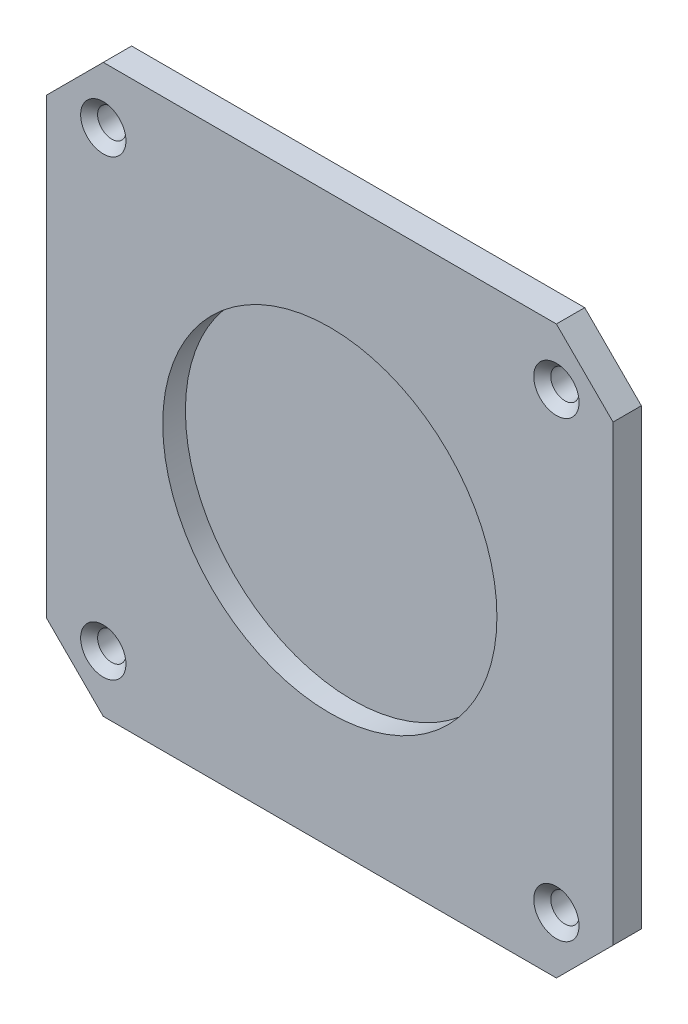
ISO-10303-21;
HEADER;
FILE_DESCRIPTION(('STEP AP214'),'2;1');
FILE_NAME('part.step','',(''),(''),'','','');
FILE_SCHEMA(('AUTOMOTIVE_DESIGN { 1 0 10303 214 1 1 1 1 }'));
ENDSEC;
DATA;
#1=APPLICATION_CONTEXT('core data for automotive mechanical design processes');
#2=APPLICATION_PROTOCOL_DEFINITION('international standard','automotive_design',2000,#1);
#3=PRODUCT_CONTEXT('',#1,'mechanical');
#4=PRODUCT('Part','Part','',(#3));
#5=PRODUCT_RELATED_PRODUCT_CATEGORY('part','',(#4));
#6=PRODUCT_DEFINITION_FORMATION('','',#4);
#7=PRODUCT_DEFINITION_CONTEXT('part definition',#1,'design');
#8=PRODUCT_DEFINITION('design','',#6,#7);
#9=PRODUCT_DEFINITION_SHAPE('','',#8);
#10=(LENGTH_UNIT() NAMED_UNIT(*) SI_UNIT(.MILLI.,.METRE.));
#11=(NAMED_UNIT(*) PLANE_ANGLE_UNIT() SI_UNIT($,.RADIAN.));
#12=(NAMED_UNIT(*) SI_UNIT($,.STERADIAN.) SOLID_ANGLE_UNIT());
#13=UNCERTAINTY_MEASURE_WITH_UNIT(LENGTH_MEASURE(1.E-05),#10,'distance_accuracy_value','');
#14=(GEOMETRIC_REPRESENTATION_CONTEXT(3) GLOBAL_UNCERTAINTY_ASSIGNED_CONTEXT((#13)) GLOBAL_UNIT_ASSIGNED_CONTEXT((#10,
#11,#12)) REPRESENTATION_CONTEXT('',''));
#15=CARTESIAN_POINT('',(0.,0.,0.));
#16=DIRECTION('',(0.,0.,1.));
#17=DIRECTION('',(1.,0.,0.));
#18=AXIS2_PLACEMENT_3D('',#15,#16,#17);
#19=CARTESIAN_POINT('',(-40.,50.,5.));
#20=DIRECTION('',(0.,-1.,0.));
#21=DIRECTION('',(0.,0.,-1.));
#22=AXIS2_PLACEMENT_3D('',#19,#20,#21);
#23=PLANE('',#22);
#24=DIRECTION('',(-1.,0.,0.));
#25=VECTOR('',#24,1.);
#26=CARTESIAN_POINT('',(-40.,50.,0.));
#27=LINE('',#26,#25);
#28=CARTESIAN_POINT('',(40.,50.,0.));
#29=VERTEX_POINT('',#28);
#30=CARTESIAN_POINT('',(-40.,50.,0.));
#31=VERTEX_POINT('',#30);
#32=EDGE_CURVE('E142',#29,#31,#27,.T.);
#33=ORIENTED_EDGE('',*,*,#32,.T.);
#34=DIRECTION('',(0.,0.,-1.));
#35=VECTOR('',#34,1.);
#36=CARTESIAN_POINT('',(-40.,50.,5.));
#37=LINE('',#36,#35);
#38=CARTESIAN_POINT('',(-40.,50.,5.));
#39=VERTEX_POINT('',#38);
#40=EDGE_CURVE('E11',#39,#31,#37,.T.);
#41=ORIENTED_EDGE('',*,*,#40,.F.);
#42=DIRECTION('',(-1.,0.,0.));
#43=VECTOR('',#42,1.);
#44=CARTESIAN_POINT('',(-40.,50.,5.));
#45=LINE('',#44,#43);
#46=CARTESIAN_POINT('',(40.,50.,5.));
#47=VERTEX_POINT('',#46);
#48=EDGE_CURVE('E165',#47,#39,#45,.T.);
#49=ORIENTED_EDGE('',*,*,#48,.F.);
#50=DIRECTION('',(0.,0.,-1.));
#51=VECTOR('',#50,1.);
#52=CARTESIAN_POINT('',(40.,50.,5.));
#53=LINE('',#52,#51);
#54=EDGE_CURVE('E138',#47,#29,#53,.T.);
#55=ORIENTED_EDGE('',*,*,#54,.T.);
#56=EDGE_LOOP('',(#33,#41,#49,#55));
#57=FACE_BOUND('',#56,.T.);
#58=ADVANCED_FACE('F39',(#57),#23,.F.);
#59=CARTESIAN_POINT('',(-50.,40.,5.));
#60=DIRECTION('',(0.707106781186548,-0.707106781186548,0.));
#61=DIRECTION('',(0.707106781186548,0.707106781186548,0.));
#62=AXIS2_PLACEMENT_3D('',#59,#60,#61);
#63=PLANE('',#62);
#64=DIRECTION('',(-0.707106781186548,-0.707106781186548,0.));
#65=VECTOR('',#64,1.);
#66=CARTESIAN_POINT('',(-50.,40.,0.));
#67=LINE('',#66,#65);
#68=CARTESIAN_POINT('',(-50.,40.,0.));
#69=VERTEX_POINT('',#68);
#70=EDGE_CURVE('E146',#31,#69,#67,.T.);
#71=ORIENTED_EDGE('',*,*,#70,.T.);
#72=DIRECTION('',(0.,0.,-1.));
#73=VECTOR('',#72,1.);
#74=CARTESIAN_POINT('',(-50.,40.,5.));
#75=LINE('',#74,#73);
#76=CARTESIAN_POINT('',(-50.,40.,5.));
#77=VERTEX_POINT('',#76);
#78=EDGE_CURVE('E48',#77,#69,#75,.T.);
#79=ORIENTED_EDGE('',*,*,#78,.F.);
#80=DIRECTION('',(-0.707106781186548,-0.707106781186548,0.));
#81=VECTOR('',#80,1.);
#82=CARTESIAN_POINT('',(-50.,40.,5.));
#83=LINE('',#82,#81);
#84=EDGE_CURVE('E99',#39,#77,#83,.T.);
#85=ORIENTED_EDGE('',*,*,#84,.F.);
#86=ORIENTED_EDGE('',*,*,#40,.T.);
#87=EDGE_LOOP('',(#71,#79,#85,#86));
#88=FACE_BOUND('',#87,.T.);
#89=ADVANCED_FACE('F293',(#88),#63,.F.);
#90=CARTESIAN_POINT('',(-50.,-40.,5.));
#91=DIRECTION('',(1.,0.,0.));
#92=DIRECTION('',(0.,0.,-1.));
#93=AXIS2_PLACEMENT_3D('',#90,#91,#92);
#94=PLANE('',#93);
#95=DIRECTION('',(0.,-1.,0.));
#96=VECTOR('',#95,1.);
#97=CARTESIAN_POINT('',(-50.,-40.,0.));
#98=LINE('',#97,#96);
#99=CARTESIAN_POINT('',(-50.,-40.,0.));
#100=VERTEX_POINT('',#99);
#101=EDGE_CURVE('E150',#69,#100,#98,.T.);
#102=ORIENTED_EDGE('',*,*,#101,.T.);
#103=DIRECTION('',(0.,0.,-1.));
#104=VECTOR('',#103,1.);
#105=CARTESIAN_POINT('',(-50.,-40.,5.));
#106=LINE('',#105,#104);
#107=CARTESIAN_POINT('',(-50.,-40.,5.));
#108=VERTEX_POINT('',#107);
#109=EDGE_CURVE('E176',#108,#100,#106,.T.);
#110=ORIENTED_EDGE('',*,*,#109,.F.);
#111=DIRECTION('',(0.,-1.,0.));
#112=VECTOR('',#111,1.);
#113=CARTESIAN_POINT('',(-50.,-40.,5.));
#114=LINE('',#113,#112);
#115=EDGE_CURVE('E187',#77,#108,#114,.T.);
#116=ORIENTED_EDGE('',*,*,#115,.F.);
#117=ORIENTED_EDGE('',*,*,#78,.T.);
#118=EDGE_LOOP('',(#102,#110,#116,#117));
#119=FACE_BOUND('',#118,.T.);
#120=ADVANCED_FACE('F185',(#119),#94,.F.);
#121=CARTESIAN_POINT('',(-50.,-40.,5.));
#122=DIRECTION('',(0.707106781186547,0.707106781186548,0.));
#123=DIRECTION('',(-0.707106781186548,0.707106781186547,0.));
#124=AXIS2_PLACEMENT_3D('',#121,#122,#123);
#125=PLANE('',#124);
#126=DIRECTION('',(0.707106781186548,-0.707106781186547,0.));
#127=VECTOR('',#126,1.);
#128=CARTESIAN_POINT('',(-50.,-40.,0.));
#129=LINE('',#128,#127);
#130=CARTESIAN_POINT('',(-40.,-50.,0.));
#131=VERTEX_POINT('',#130);
#132=EDGE_CURVE('E153',#100,#131,#129,.T.);
#133=ORIENTED_EDGE('',*,*,#132,.T.);
#134=DIRECTION('',(0.,0.,-1.));
#135=VECTOR('',#134,1.);
#136=CARTESIAN_POINT('',(-40.,-50.,5.));
#137=LINE('',#136,#135);
#138=CARTESIAN_POINT('',(-40.,-50.,5.));
#139=VERTEX_POINT('',#138);
#140=EDGE_CURVE('E172',#139,#131,#137,.T.);
#141=ORIENTED_EDGE('',*,*,#140,.F.);
#142=DIRECTION('',(0.707106781186548,-0.707106781186547,0.));
#143=VECTOR('',#142,1.);
#144=CARTESIAN_POINT('',(-50.,-40.,5.));
#145=LINE('',#144,#143);
#146=EDGE_CURVE('E200',#108,#139,#145,.T.);
#147=ORIENTED_EDGE('',*,*,#146,.F.);
#148=ORIENTED_EDGE('',*,*,#109,.T.);
#149=EDGE_LOOP('',(#133,#141,#147,#148));
#150=FACE_BOUND('',#149,.T.);
#151=ADVANCED_FACE('F195',(#150),#125,.F.);
#152=CARTESIAN_POINT('',(-40.,-50.,5.));
#153=DIRECTION('',(0.,1.,0.));
#154=DIRECTION('',(0.,0.,1.));
#155=AXIS2_PLACEMENT_3D('',#152,#153,#154);
#156=PLANE('',#155);
#157=DIRECTION('',(1.,0.,0.));
#158=VECTOR('',#157,1.);
#159=CARTESIAN_POINT('',(-40.,-50.,0.));
#160=LINE('',#159,#158);
#161=CARTESIAN_POINT('',(40.,-50.,0.));
#162=VERTEX_POINT('',#161);
#163=EDGE_CURVE('E156',#131,#162,#160,.T.);
#164=ORIENTED_EDGE('',*,*,#163,.T.);
#165=DIRECTION('',(0.,0.,-1.));
#166=VECTOR('',#165,1.);
#167=CARTESIAN_POINT('',(40.,-50.,5.));
#168=LINE('',#167,#166);
#169=CARTESIAN_POINT('',(40.,-50.,5.));
#170=VERTEX_POINT('',#169);
#171=EDGE_CURVE('E129',#170,#162,#168,.T.);
#172=ORIENTED_EDGE('',*,*,#171,.F.);
#173=DIRECTION('',(1.,0.,0.));
#174=VECTOR('',#173,1.);
#175=CARTESIAN_POINT('',(-40.,-50.,5.));
#176=LINE('',#175,#174);
#177=EDGE_CURVE('E118',#139,#170,#176,.T.);
#178=ORIENTED_EDGE('',*,*,#177,.F.);
#179=ORIENTED_EDGE('',*,*,#140,.T.);
#180=EDGE_LOOP('',(#164,#172,#178,#179));
#181=FACE_BOUND('',#180,.T.);
#182=ADVANCED_FACE('F198',(#181),#156,.F.);
#183=CARTESIAN_POINT('',(40.,-50.,5.));
#184=DIRECTION('',(-0.707106781186547,0.707106781186548,0.));
#185=DIRECTION('',(-0.707106781186548,-0.707106781186547,0.));
#186=AXIS2_PLACEMENT_3D('',#183,#184,#185);
#187=PLANE('',#186);
#188=DIRECTION('',(0.707106781186548,0.707106781186547,0.));
#189=VECTOR('',#188,1.);
#190=CARTESIAN_POINT('',(40.,-50.,0.));
#191=LINE('',#190,#189);
#192=CARTESIAN_POINT('',(50.,-40.,0.));
#193=VERTEX_POINT('',#192);
#194=EDGE_CURVE('E127',#162,#193,#191,.T.);
#195=ORIENTED_EDGE('',*,*,#194,.T.);
#196=DIRECTION('',(0.,0.,-1.));
#197=VECTOR('',#196,1.);
#198=CARTESIAN_POINT('',(50.,-40.,5.));
#199=LINE('',#198,#197);
#200=CARTESIAN_POINT('',(50.,-40.,5.));
#201=VERTEX_POINT('',#200);
#202=EDGE_CURVE('E124',#201,#193,#199,.T.);
#203=ORIENTED_EDGE('',*,*,#202,.F.);
#204=DIRECTION('',(0.707106781186548,0.707106781186547,0.));
#205=VECTOR('',#204,1.);
#206=CARTESIAN_POINT('',(40.,-50.,5.));
#207=LINE('',#206,#205);
#208=EDGE_CURVE('E112',#170,#201,#207,.T.);
#209=ORIENTED_EDGE('',*,*,#208,.F.);
#210=ORIENTED_EDGE('',*,*,#171,.T.);
#211=EDGE_LOOP('',(#195,#203,#209,#210));
#212=FACE_BOUND('',#211,.T.);
#213=ADVANCED_FACE('F125',(#212),#187,.F.);
#214=CARTESIAN_POINT('',(50.,-40.,5.));
#215=DIRECTION('',(-1.,0.,0.));
#216=DIRECTION('',(0.,-1.,0.));
#217=AXIS2_PLACEMENT_3D('',#214,#215,#216);
#218=PLANE('',#217);
#219=DIRECTION('',(0.,1.,0.));
#220=VECTOR('',#219,1.);
#221=CARTESIAN_POINT('',(50.,-40.,0.));
#222=LINE('',#221,#220);
#223=CARTESIAN_POINT('',(50.,40.,0.));
#224=VERTEX_POINT('',#223);
#225=EDGE_CURVE('E85',#193,#224,#222,.T.);
#226=ORIENTED_EDGE('',*,*,#225,.T.);
#227=DIRECTION('',(0.,0.,-1.));
#228=VECTOR('',#227,1.);
#229=CARTESIAN_POINT('',(50.,40.,5.));
#230=LINE('',#229,#228);
#231=CARTESIAN_POINT('',(50.,40.,5.));
#232=VERTEX_POINT('',#231);
#233=EDGE_CURVE('E130',#232,#224,#230,.T.);
#234=ORIENTED_EDGE('',*,*,#233,.F.);
#235=DIRECTION('',(0.,1.,0.));
#236=VECTOR('',#235,1.);
#237=CARTESIAN_POINT('',(50.,-40.,5.));
#238=LINE('',#237,#236);
#239=EDGE_CURVE('E116',#201,#232,#238,.T.);
#240=ORIENTED_EDGE('',*,*,#239,.F.);
#241=ORIENTED_EDGE('',*,*,#202,.T.);
#242=EDGE_LOOP('',(#226,#234,#240,#241));
#243=FACE_BOUND('',#242,.T.);
#244=ADVANCED_FACE('F132',(#243),#218,.F.);
#245=CARTESIAN_POINT('',(40.,50.,5.));
#246=DIRECTION('',(-0.707106781186548,-0.707106781186547,0.));
#247=DIRECTION('',(0.707106781186547,-0.707106781186548,0.));
#248=AXIS2_PLACEMENT_3D('',#245,#246,#247);
#249=PLANE('',#248);
#250=DIRECTION('',(-0.707106781186547,0.707106781186548,0.));
#251=VECTOR('',#250,1.);
#252=CARTESIAN_POINT('',(40.,50.,0.));
#253=LINE('',#252,#251);
#254=EDGE_CURVE('E91',#224,#29,#253,.T.);
#255=ORIENTED_EDGE('',*,*,#254,.T.);
#256=ORIENTED_EDGE('',*,*,#54,.F.);
#257=DIRECTION('',(-0.707106781186547,0.707106781186548,0.));
#258=VECTOR('',#257,1.);
#259=CARTESIAN_POINT('',(40.,50.,5.));
#260=LINE('',#259,#258);
#261=EDGE_CURVE('E56',#232,#47,#260,.T.);
#262=ORIENTED_EDGE('',*,*,#261,.F.);
#263=ORIENTED_EDGE('',*,*,#233,.T.);
#264=EDGE_LOOP('',(#255,#256,#262,#263));
#265=FACE_BOUND('',#264,.T.);
#266=ADVANCED_FACE('F267',(#265),#249,.F.);
#267=CARTESIAN_POINT('',(0.,0.,5.));
#268=DIRECTION('',(0.,0.,1.));
#269=DIRECTION('',(1.,0.,0.));
#270=AXIS2_PLACEMENT_3D('',#267,#268,#269);
#271=PLANE('',#270);
#272=CARTESIAN_POINT('',(-40.,40.,5.));
#273=DIRECTION('',(0.,0.,1.));
#274=DIRECTION('',(1.,0.,0.));
#275=AXIS2_PLACEMENT_3D('',#272,#273,#274);
#276=CIRCLE('',#275,4.);
#277=CARTESIAN_POINT('',(-36.,40.,5.));
#278=VERTEX_POINT('',#277);
#279=EDGE_CURVE('E258',#278,#278,#276,.T.);
#280=ORIENTED_EDGE('',*,*,#279,.F.);
#281=EDGE_LOOP('',(#280));
#282=FACE_BOUND('',#281,.T.);
#283=CARTESIAN_POINT('',(40.,40.,5.));
#284=DIRECTION('',(0.,0.,1.));
#285=DIRECTION('',(1.,0.,0.));
#286=AXIS2_PLACEMENT_3D('',#283,#284,#285);
#287=CIRCLE('',#286,4.);
#288=CARTESIAN_POINT('',(44.,40.,5.));
#289=VERTEX_POINT('',#288);
#290=EDGE_CURVE('E247',#289,#289,#287,.T.);
#291=ORIENTED_EDGE('',*,*,#290,.F.);
#292=EDGE_LOOP('',(#291));
#293=FACE_BOUND('',#292,.T.);
#294=CARTESIAN_POINT('',(40.,-40.,5.));
#295=DIRECTION('',(0.,0.,1.));
#296=DIRECTION('',(1.,0.,0.));
#297=AXIS2_PLACEMENT_3D('',#294,#295,#296);
#298=CIRCLE('',#297,4.);
#299=CARTESIAN_POINT('',(44.,-40.,5.));
#300=VERTEX_POINT('',#299);
#301=EDGE_CURVE('E235',#300,#300,#298,.T.);
#302=ORIENTED_EDGE('',*,*,#301,.F.);
#303=EDGE_LOOP('',(#302));
#304=FACE_BOUND('',#303,.T.);
#305=CARTESIAN_POINT('',(-40.,-40.,5.));
#306=DIRECTION('',(0.,0.,1.));
#307=DIRECTION('',(1.,0.,0.));
#308=AXIS2_PLACEMENT_3D('',#305,#306,#307);
#309=CIRCLE('',#308,4.);
#310=CARTESIAN_POINT('',(-36.,-40.,5.));
#311=VERTEX_POINT('',#310);
#312=EDGE_CURVE('E224',#311,#311,#309,.T.);
#313=ORIENTED_EDGE('',*,*,#312,.F.);
#314=EDGE_LOOP('',(#313));
#315=FACE_BOUND('',#314,.T.);
#316=CARTESIAN_POINT('',(0.,0.,5.));
#317=DIRECTION('',(0.,0.,1.));
#318=DIRECTION('',(1.,0.,0.));
#319=AXIS2_PLACEMENT_3D('',#316,#317,#318);
#320=CIRCLE('',#319,29.5);
#321=CARTESIAN_POINT('',(29.5,0.,5.));
#322=VERTEX_POINT('',#321);
#323=EDGE_CURVE('E209',#322,#322,#320,.T.);
#324=ORIENTED_EDGE('',*,*,#323,.F.);
#325=EDGE_LOOP('',(#324));
#326=FACE_BOUND('',#325,.T.);
#327=ORIENTED_EDGE('',*,*,#48,.T.);
#328=ORIENTED_EDGE('',*,*,#84,.T.);
#329=ORIENTED_EDGE('',*,*,#115,.T.);
#330=ORIENTED_EDGE('',*,*,#146,.T.);
#331=ORIENTED_EDGE('',*,*,#177,.T.);
#332=ORIENTED_EDGE('',*,*,#208,.T.);
#333=ORIENTED_EDGE('',*,*,#239,.T.);
#334=ORIENTED_EDGE('',*,*,#261,.T.);
#335=EDGE_LOOP('',(#327,#328,#329,#330,#331,#332,#333,#334));
#336=FACE_BOUND('',#335,.T.);
#337=ADVANCED_FACE('F114',(#282,#293,#304,#315,#326,#336),#271,.T.);
#338=CARTESIAN_POINT('',(0.,0.,0.));
#339=DIRECTION('',(0.,0.,1.));
#340=DIRECTION('',(1.,0.,0.));
#341=AXIS2_PLACEMENT_3D('',#338,#339,#340);
#342=PLANE('',#341);
#343=CARTESIAN_POINT('',(-40.,40.,0.));
#344=DIRECTION('',(0.,0.,1.));
#345=DIRECTION('',(1.,0.,0.));
#346=AXIS2_PLACEMENT_3D('',#343,#344,#345);
#347=CIRCLE('',#346,2.5);
#348=CARTESIAN_POINT('',(-37.5,40.,0.));
#349=VERTEX_POINT('',#348);
#350=EDGE_CURVE('E250',#349,#349,#347,.T.);
#351=ORIENTED_EDGE('',*,*,#350,.T.);
#352=EDGE_LOOP('',(#351));
#353=FACE_BOUND('',#352,.T.);
#354=CARTESIAN_POINT('',(40.,40.,0.));
#355=DIRECTION('',(0.,0.,1.));
#356=DIRECTION('',(1.,0.,0.));
#357=AXIS2_PLACEMENT_3D('',#354,#355,#356);
#358=CIRCLE('',#357,2.5);
#359=CARTESIAN_POINT('',(42.5,40.,0.));
#360=VERTEX_POINT('',#359);
#361=EDGE_CURVE('E239',#360,#360,#358,.T.);
#362=ORIENTED_EDGE('',*,*,#361,.T.);
#363=EDGE_LOOP('',(#362));
#364=FACE_BOUND('',#363,.T.);
#365=CARTESIAN_POINT('',(40.,-40.,0.));
#366=DIRECTION('',(0.,0.,1.));
#367=DIRECTION('',(1.,0.,0.));
#368=AXIS2_PLACEMENT_3D('',#365,#366,#367);
#369=CIRCLE('',#368,2.5);
#370=CARTESIAN_POINT('',(42.5,-40.,0.));
#371=VERTEX_POINT('',#370);
#372=EDGE_CURVE('E228',#371,#371,#369,.T.);
#373=ORIENTED_EDGE('',*,*,#372,.T.);
#374=EDGE_LOOP('',(#373));
#375=FACE_BOUND('',#374,.T.);
#376=CARTESIAN_POINT('',(-40.,-40.,0.));
#377=DIRECTION('',(0.,0.,1.));
#378=DIRECTION('',(1.,0.,0.));
#379=AXIS2_PLACEMENT_3D('',#376,#377,#378);
#380=CIRCLE('',#379,2.5);
#381=CARTESIAN_POINT('',(-37.5,-40.,0.));
#382=VERTEX_POINT('',#381);
#383=EDGE_CURVE('E213',#382,#382,#380,.T.);
#384=ORIENTED_EDGE('',*,*,#383,.T.);
#385=EDGE_LOOP('',(#384));
#386=FACE_BOUND('',#385,.T.);
#387=ORIENTED_EDGE('',*,*,#32,.F.);
#388=ORIENTED_EDGE('',*,*,#254,.F.);
#389=ORIENTED_EDGE('',*,*,#225,.F.);
#390=ORIENTED_EDGE('',*,*,#194,.F.);
#391=ORIENTED_EDGE('',*,*,#163,.F.);
#392=ORIENTED_EDGE('',*,*,#132,.F.);
#393=ORIENTED_EDGE('',*,*,#101,.F.);
#394=ORIENTED_EDGE('',*,*,#70,.F.);
#395=EDGE_LOOP('',(#387,#388,#389,#390,#391,#392,#393,#394));
#396=FACE_BOUND('',#395,.T.);
#397=ADVANCED_FACE('F191',(#353,#364,#375,#386,#396),#342,.F.);
#398=CARTESIAN_POINT('',(0.,0.,1.));
#399=DIRECTION('',(0.,0.,1.));
#400=DIRECTION('',(1.,0.,0.));
#401=AXIS2_PLACEMENT_3D('',#398,#399,#400);
#402=CYLINDRICAL_SURFACE('',#401,29.5);
#403=CARTESIAN_POINT('',(0.,0.,1.));
#404=DIRECTION('',(0.,0.,1.));
#405=DIRECTION('',(1.,0.,0.));
#406=AXIS2_PLACEMENT_3D('',#403,#404,#405);
#407=CIRCLE('',#406,29.5);
#408=CARTESIAN_POINT('',(29.5,0.,1.));
#409=VERTEX_POINT('',#408);
#410=EDGE_CURVE('E147',#409,#409,#407,.T.);
#411=ORIENTED_EDGE('',*,*,#410,.F.);
#412=EDGE_LOOP('',(#411));
#413=FACE_BOUND('',#412,.T.);
#414=ORIENTED_EDGE('',*,*,#323,.T.);
#415=EDGE_LOOP('',(#414));
#416=FACE_BOUND('',#415,.T.);
#417=ADVANCED_FACE('F277',(#413,#416),#402,.F.);
#418=CARTESIAN_POINT('',(0.,0.,1.));
#419=DIRECTION('',(0.,0.,1.));
#420=DIRECTION('',(1.,0.,0.));
#421=AXIS2_PLACEMENT_3D('',#418,#419,#420);
#422=PLANE('',#421);
#423=ORIENTED_EDGE('',*,*,#410,.T.);
#424=EDGE_LOOP('',(#423));
#425=FACE_BOUND('',#424,.T.);
#426=ADVANCED_FACE('F279',(#425),#422,.T.);
#427=CARTESIAN_POINT('',(-40.,-40.,5.));
#428=DIRECTION('',(0.,0.,1.));
#429=DIRECTION('',(1.,0.,0.));
#430=AXIS2_PLACEMENT_3D('',#427,#428,#429);
#431=CYLINDRICAL_SURFACE('',#430,2.5);
#432=ORIENTED_EDGE('',*,*,#383,.F.);
#433=EDGE_LOOP('',(#432));
#434=FACE_BOUND('',#433,.T.);
#435=CARTESIAN_POINT('',(-40.,-40.,3.5));
#436=DIRECTION('',(0.,0.,1.));
#437=DIRECTION('',(1.,0.,0.));
#438=AXIS2_PLACEMENT_3D('',#435,#436,#437);
#439=CIRCLE('',#438,2.5);
#440=CARTESIAN_POINT('',(-37.5,-40.,3.5));
#441=VERTEX_POINT('',#440);
#442=EDGE_CURVE('E220',#441,#441,#439,.T.);
#443=ORIENTED_EDGE('',*,*,#442,.T.);
#444=EDGE_LOOP('',(#443));
#445=FACE_BOUND('',#444,.T.);
#446=ADVANCED_FACE('F286',(#434,#445),#431,.F.);
#447=CARTESIAN_POINT('',(-40.,-40.,5.));
#448=DIRECTION('',(0.,0.,1.));
#449=DIRECTION('',(1.,0.,0.));
#450=AXIS2_PLACEMENT_3D('',#447,#448,#449);
#451=CONICAL_SURFACE('',#450,4.,0.785398163397451);
#452=ORIENTED_EDGE('',*,*,#442,.F.);
#453=EDGE_LOOP('',(#452));
#454=FACE_BOUND('',#453,.T.);
#455=ORIENTED_EDGE('',*,*,#312,.T.);
#456=EDGE_LOOP('',(#455));
#457=FACE_BOUND('',#456,.T.);
#458=ADVANCED_FACE('F358',(#454,#457),#451,.F.);
#459=CARTESIAN_POINT('',(40.,-40.,5.));
#460=DIRECTION('',(0.,0.,1.));
#461=DIRECTION('',(1.,0.,0.));
#462=AXIS2_PLACEMENT_3D('',#459,#460,#461);
#463=CYLINDRICAL_SURFACE('',#462,2.5);
#464=ORIENTED_EDGE('',*,*,#372,.F.);
#465=EDGE_LOOP('',(#464));
#466=FACE_BOUND('',#465,.T.);
#467=CARTESIAN_POINT('',(40.,-40.,3.5));
#468=DIRECTION('',(0.,0.,1.));
#469=DIRECTION('',(1.,0.,0.));
#470=AXIS2_PLACEMENT_3D('',#467,#468,#469);
#471=CIRCLE('',#470,2.5);
#472=CARTESIAN_POINT('',(42.5,-40.,3.5));
#473=VERTEX_POINT('',#472);
#474=EDGE_CURVE('E232',#473,#473,#471,.T.);
#475=ORIENTED_EDGE('',*,*,#474,.T.);
#476=EDGE_LOOP('',(#475));
#477=FACE_BOUND('',#476,.T.);
#478=ADVANCED_FACE('F367',(#466,#477),#463,.F.);
#479=CARTESIAN_POINT('',(40.,-40.,5.));
#480=DIRECTION('',(0.,0.,1.));
#481=DIRECTION('',(1.,0.,0.));
#482=AXIS2_PLACEMENT_3D('',#479,#480,#481);
#483=CONICAL_SURFACE('',#482,4.,0.785398163397451);
#484=ORIENTED_EDGE('',*,*,#474,.F.);
#485=EDGE_LOOP('',(#484));
#486=FACE_BOUND('',#485,.T.);
#487=ORIENTED_EDGE('',*,*,#301,.T.);
#488=EDGE_LOOP('',(#487));
#489=FACE_BOUND('',#488,.T.);
#490=ADVANCED_FACE('F376',(#486,#489),#483,.F.);
#491=CARTESIAN_POINT('',(40.,40.,5.));
#492=DIRECTION('',(0.,0.,1.));
#493=DIRECTION('',(1.,0.,0.));
#494=AXIS2_PLACEMENT_3D('',#491,#492,#493);
#495=CYLINDRICAL_SURFACE('',#494,2.5);
#496=ORIENTED_EDGE('',*,*,#361,.F.);
#497=EDGE_LOOP('',(#496));
#498=FACE_BOUND('',#497,.T.);
#499=CARTESIAN_POINT('',(40.,40.,3.5));
#500=DIRECTION('',(0.,0.,1.));
#501=DIRECTION('',(1.,0.,0.));
#502=AXIS2_PLACEMENT_3D('',#499,#500,#501);
#503=CIRCLE('',#502,2.5);
#504=CARTESIAN_POINT('',(42.5,40.,3.5));
#505=VERTEX_POINT('',#504);
#506=EDGE_CURVE('E243',#505,#505,#503,.T.);
#507=ORIENTED_EDGE('',*,*,#506,.T.);
#508=EDGE_LOOP('',(#507));
#509=FACE_BOUND('',#508,.T.);
#510=ADVANCED_FACE('F385',(#498,#509),#495,.F.);
#511=CARTESIAN_POINT('',(40.,40.,5.));
#512=DIRECTION('',(0.,0.,1.));
#513=DIRECTION('',(1.,0.,0.));
#514=AXIS2_PLACEMENT_3D('',#511,#512,#513);
#515=CONICAL_SURFACE('',#514,4.,0.785398163397448);
#516=ORIENTED_EDGE('',*,*,#506,.F.);
#517=EDGE_LOOP('',(#516));
#518=FACE_BOUND('',#517,.T.);
#519=ORIENTED_EDGE('',*,*,#290,.T.);
#520=EDGE_LOOP('',(#519));
#521=FACE_BOUND('',#520,.T.);
#522=ADVANCED_FACE('F394',(#518,#521),#515,.F.);
#523=CARTESIAN_POINT('',(-40.,40.,5.));
#524=DIRECTION('',(0.,0.,1.));
#525=DIRECTION('',(1.,0.,0.));
#526=AXIS2_PLACEMENT_3D('',#523,#524,#525);
#527=CYLINDRICAL_SURFACE('',#526,2.5);
#528=ORIENTED_EDGE('',*,*,#350,.F.);
#529=EDGE_LOOP('',(#528));
#530=FACE_BOUND('',#529,.T.);
#531=CARTESIAN_POINT('',(-40.,40.,3.5));
#532=DIRECTION('',(0.,0.,1.));
#533=DIRECTION('',(1.,0.,0.));
#534=AXIS2_PLACEMENT_3D('',#531,#532,#533);
#535=CIRCLE('',#534,2.5);
#536=CARTESIAN_POINT('',(-37.5,40.,3.5));
#537=VERTEX_POINT('',#536);
#538=EDGE_CURVE('E254',#537,#537,#535,.T.);
#539=ORIENTED_EDGE('',*,*,#538,.T.);
#540=EDGE_LOOP('',(#539));
#541=FACE_BOUND('',#540,.T.);
#542=ADVANCED_FACE('F403',(#530,#541),#527,.F.);
#543=CARTESIAN_POINT('',(-40.,40.,5.));
#544=DIRECTION('',(0.,0.,1.));
#545=DIRECTION('',(1.,0.,0.));
#546=AXIS2_PLACEMENT_3D('',#543,#544,#545);
#547=CONICAL_SURFACE('',#546,4.,0.785398163397451);
#548=ORIENTED_EDGE('',*,*,#538,.F.);
#549=EDGE_LOOP('',(#548));
#550=FACE_BOUND('',#549,.T.);
#551=ORIENTED_EDGE('',*,*,#279,.T.);
#552=EDGE_LOOP('',(#551));
#553=FACE_BOUND('',#552,.T.);
#554=ADVANCED_FACE('F263',(#550,#553),#547,.F.);
#555=CLOSED_SHELL('',(#58,#89,#120,#151,#182,#213,#244,#266,#337,#397,#417,#426,#446,#458,#478,
#490,#510,#522,#542,#554));
#556=MANIFOLD_SOLID_BREP('B2',#555);
#557=ADVANCED_BREP_SHAPE_REPRESENTATION('',(#18,#556),#14);
#558=SHAPE_DEFINITION_REPRESENTATION(#9,#557);
ENDSEC;
END-ISO-10303-21;
